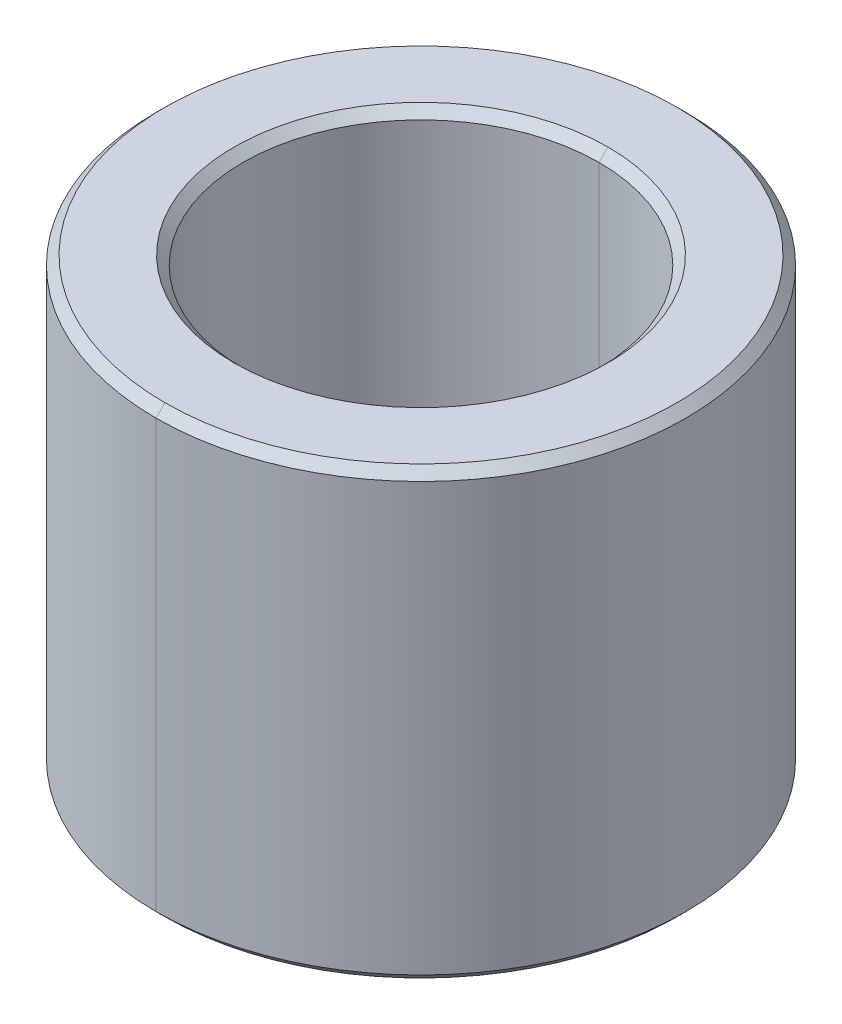
ISO-10303-21;
HEADER;
FILE_DESCRIPTION(('STEP AP214'),'2;1');
FILE_NAME('part.step','',(''),(''),'','','');
FILE_SCHEMA(('AUTOMOTIVE_DESIGN { 1 0 10303 214 1 1 1 1 }'));
ENDSEC;
DATA;
#1=APPLICATION_CONTEXT('core data for automotive mechanical design processes');
#2=APPLICATION_PROTOCOL_DEFINITION('international standard','automotive_design',2000,#1);
#3=PRODUCT_CONTEXT('',#1,'mechanical');
#4=PRODUCT('Part','Part','',(#3));
#5=PRODUCT_RELATED_PRODUCT_CATEGORY('part','',(#4));
#6=PRODUCT_DEFINITION_FORMATION('','',#4);
#7=PRODUCT_DEFINITION_CONTEXT('part definition',#1,'design');
#8=PRODUCT_DEFINITION('design','',#6,#7);
#9=PRODUCT_DEFINITION_SHAPE('','',#8);
#10=(LENGTH_UNIT() NAMED_UNIT(*) SI_UNIT(.MILLI.,.METRE.));
#11=(NAMED_UNIT(*) PLANE_ANGLE_UNIT() SI_UNIT($,.RADIAN.));
#12=(NAMED_UNIT(*) SI_UNIT($,.STERADIAN.) SOLID_ANGLE_UNIT());
#13=UNCERTAINTY_MEASURE_WITH_UNIT(LENGTH_MEASURE(1.E-05),#10,'distance_accuracy_value','');
#14=(GEOMETRIC_REPRESENTATION_CONTEXT(3) GLOBAL_UNCERTAINTY_ASSIGNED_CONTEXT((#13)) GLOBAL_UNIT_ASSIGNED_CONTEXT((#10,
#11,#12)) REPRESENTATION_CONTEXT('',''));
#15=CARTESIAN_POINT('',(0.,0.,0.));
#16=DIRECTION('',(0.,0.,1.));
#17=DIRECTION('',(1.,0.,0.));
#18=AXIS2_PLACEMENT_3D('',#15,#16,#17);
#19=CARTESIAN_POINT('',(0.,2.4,0.));
#20=DIRECTION('',(0.,1.,0.));
#21=DIRECTION('',(0.,0.,1.));
#22=AXIS2_PLACEMENT_3D('',#19,#20,#21);
#23=CONICAL_SURFACE('',#22,2.,0.78539816339745);
#24=DIRECTION('',(0.,0.707106781186546,-0.707106781186549));
#25=VECTOR('',#24,1.);
#26=CARTESIAN_POINT('',(0.,2.4,-2.));
#27=LINE('',#26,#25);
#28=CARTESIAN_POINT('',(0.,2.4,-2.));
#29=VERTEX_POINT('',#28);
#30=CARTESIAN_POINT('',(0.,2.5,-2.1));
#31=VERTEX_POINT('',#30);
#32=EDGE_CURVE('E250',#29,#31,#27,.T.);
#33=ORIENTED_EDGE('',*,*,#32,.F.);
#34=CARTESIAN_POINT('',(0.,2.4,0.));
#35=DIRECTION('',(0.,1.,0.));
#36=DIRECTION('',(0.,0.,1.));
#37=AXIS2_PLACEMENT_3D('',#34,#35,#36);
#38=CIRCLE('',#37,2.);
#39=CARTESIAN_POINT('',(0.,2.4,2.));
#40=VERTEX_POINT('',#39);
#41=EDGE_CURVE('E26',#40,#29,#38,.T.);
#42=ORIENTED_EDGE('',*,*,#41,.F.);
#43=DIRECTION('',(0.,0.707106781186546,0.707106781186549));
#44=VECTOR('',#43,1.);
#45=CARTESIAN_POINT('',(0.,2.4,2.));
#46=LINE('',#45,#44);
#47=CARTESIAN_POINT('',(0.,2.5,2.1));
#48=VERTEX_POINT('',#47);
#49=EDGE_CURVE('E155',#40,#48,#46,.T.);
#50=ORIENTED_EDGE('',*,*,#49,.T.);
#51=CARTESIAN_POINT('',(0.,2.5,0.));
#52=DIRECTION('',(0.,-1.,0.));
#53=DIRECTION('',(0.,0.,1.));
#54=AXIS2_PLACEMENT_3D('',#51,#52,#53);
#55=CIRCLE('',#54,2.1);
#56=EDGE_CURVE('E111',#31,#48,#55,.T.);
#57=ORIENTED_EDGE('',*,*,#56,.F.);
#58=EDGE_LOOP('',(#33,#42,#50,#57));
#59=FACE_BOUND('',#58,.T.);
#60=ADVANCED_FACE('F15',(#59),#23,.F.);
#61=CARTESIAN_POINT('',(0.,-2.5,0.));
#62=DIRECTION('',(0.,-1.,0.));
#63=DIRECTION('',(0.,0.,-1.));
#64=AXIS2_PLACEMENT_3D('',#61,#62,#63);
#65=CONICAL_SURFACE('',#64,2.1,0.78539816339744);
#66=DIRECTION('',(0.,-0.707106781186554,0.707106781186542));
#67=VECTOR('',#66,1.);
#68=CARTESIAN_POINT('',(0.,-2.5,2.1));
#69=LINE('',#68,#67);
#70=CARTESIAN_POINT('',(0.,-2.4,2.));
#71=VERTEX_POINT('',#70);
#72=CARTESIAN_POINT('',(0.,-2.5,2.1));
#73=VERTEX_POINT('',#72);
#74=EDGE_CURVE('E133',#71,#73,#69,.T.);
#75=ORIENTED_EDGE('',*,*,#74,.F.);
#76=CARTESIAN_POINT('',(0.,-2.4,0.));
#77=DIRECTION('',(0.,-1.,0.));
#78=DIRECTION('',(0.,0.,1.));
#79=AXIS2_PLACEMENT_3D('',#76,#77,#78);
#80=CIRCLE('',#79,2.);
#81=CARTESIAN_POINT('',(0.,-2.4,-2.));
#82=VERTEX_POINT('',#81);
#83=EDGE_CURVE('E10',#82,#71,#80,.T.);
#84=ORIENTED_EDGE('',*,*,#83,.F.);
#85=DIRECTION('',(0.,-0.707106781186554,-0.707106781186542));
#86=VECTOR('',#85,1.);
#87=CARTESIAN_POINT('',(0.,-2.5,-2.1));
#88=LINE('',#87,#86);
#89=CARTESIAN_POINT('',(0.,-2.5,-2.1));
#90=VERTEX_POINT('',#89);
#91=EDGE_CURVE('E136',#82,#90,#88,.T.);
#92=ORIENTED_EDGE('',*,*,#91,.T.);
#93=CARTESIAN_POINT('',(0.,-2.5,0.));
#94=DIRECTION('',(0.,1.,0.));
#95=DIRECTION('',(0.,0.,1.));
#96=AXIS2_PLACEMENT_3D('',#93,#94,#95);
#97=CIRCLE('',#96,2.1);
#98=EDGE_CURVE('E126',#73,#90,#97,.T.);
#99=ORIENTED_EDGE('',*,*,#98,.F.);
#100=EDGE_LOOP('',(#75,#84,#92,#99));
#101=FACE_BOUND('',#100,.T.);
#102=ADVANCED_FACE('F17',(#101),#65,.F.);
#103=CARTESIAN_POINT('',(0.,2.5,0.));
#104=DIRECTION('',(0.,-1.,0.));
#105=DIRECTION('',(0.,0.,-1.));
#106=AXIS2_PLACEMENT_3D('',#103,#104,#105);
#107=CONICAL_SURFACE('',#106,2.875,0.78539816339744);
#108=DIRECTION('',(0.,-0.707106781186554,0.707106781186542));
#109=VECTOR('',#108,1.);
#110=CARTESIAN_POINT('',(0.,2.5,2.875));
#111=LINE('',#110,#109);
#112=CARTESIAN_POINT('',(0.,2.5,2.875));
#113=VERTEX_POINT('',#112);
#114=CARTESIAN_POINT('',(0.,2.4,2.975));
#115=VERTEX_POINT('',#114);
#116=EDGE_CURVE('E173',#113,#115,#111,.T.);
#117=ORIENTED_EDGE('',*,*,#116,.F.);
#118=CARTESIAN_POINT('',(0.,2.5,0.));
#119=DIRECTION('',(0.,1.,0.));
#120=DIRECTION('',(0.,0.,1.));
#121=AXIS2_PLACEMENT_3D('',#118,#119,#120);
#122=CIRCLE('',#121,2.875);
#123=CARTESIAN_POINT('',(0.,2.5,-2.875));
#124=VERTEX_POINT('',#123);
#125=EDGE_CURVE('E160',#124,#113,#122,.T.);
#126=ORIENTED_EDGE('',*,*,#125,.F.);
#127=DIRECTION('',(0.,-0.707106781186554,-0.707106781186542));
#128=VECTOR('',#127,1.);
#129=CARTESIAN_POINT('',(0.,2.5,-2.875));
#130=LINE('',#129,#128);
#131=CARTESIAN_POINT('',(0.,2.4,-2.975));
#132=VERTEX_POINT('',#131);
#133=EDGE_CURVE('E172',#124,#132,#130,.T.);
#134=ORIENTED_EDGE('',*,*,#133,.T.);
#135=CARTESIAN_POINT('',(0.,2.4,0.));
#136=DIRECTION('',(0.,-1.,0.));
#137=DIRECTION('',(0.,0.,1.));
#138=AXIS2_PLACEMENT_3D('',#135,#136,#137);
#139=CIRCLE('',#138,2.975);
#140=EDGE_CURVE('E66',#115,#132,#139,.T.);
#141=ORIENTED_EDGE('',*,*,#140,.F.);
#142=EDGE_LOOP('',(#117,#126,#134,#141));
#143=FACE_BOUND('',#142,.T.);
#144=ADVANCED_FACE('F198',(#143),#107,.T.);
#145=CARTESIAN_POINT('',(0.,-2.4,0.));
#146=DIRECTION('',(0.,1.,0.));
#147=DIRECTION('',(0.,0.,1.));
#148=AXIS2_PLACEMENT_3D('',#145,#146,#147);
#149=CONICAL_SURFACE('',#148,2.975,0.785398163397446);
#150=DIRECTION('',(0.,0.707106781186549,-0.707106781186546));
#151=VECTOR('',#150,1.);
#152=CARTESIAN_POINT('',(0.,-2.4,-2.975));
#153=LINE('',#152,#151);
#154=CARTESIAN_POINT('',(0.,-2.5,-2.875));
#155=VERTEX_POINT('',#154);
#156=CARTESIAN_POINT('',(0.,-2.4,-2.975));
#157=VERTEX_POINT('',#156);
#158=EDGE_CURVE('E174',#155,#157,#153,.T.);
#159=ORIENTED_EDGE('',*,*,#158,.F.);
#160=CARTESIAN_POINT('',(0.,-2.5,0.));
#161=DIRECTION('',(0.,-1.,0.));
#162=DIRECTION('',(0.,0.,1.));
#163=AXIS2_PLACEMENT_3D('',#160,#161,#162);
#164=CIRCLE('',#163,2.875);
#165=CARTESIAN_POINT('',(0.,-2.5,2.875));
#166=VERTEX_POINT('',#165);
#167=EDGE_CURVE('E57',#166,#155,#164,.T.);
#168=ORIENTED_EDGE('',*,*,#167,.F.);
#169=DIRECTION('',(0.,0.707106781186549,0.707106781186546));
#170=VECTOR('',#169,1.);
#171=CARTESIAN_POINT('',(0.,-2.4,2.975));
#172=LINE('',#171,#170);
#173=CARTESIAN_POINT('',(0.,-2.4,2.975));
#174=VERTEX_POINT('',#173);
#175=EDGE_CURVE('E166',#166,#174,#172,.T.);
#176=ORIENTED_EDGE('',*,*,#175,.T.);
#177=CARTESIAN_POINT('',(0.,-2.4,0.));
#178=DIRECTION('',(0.,1.,0.));
#179=DIRECTION('',(0.,0.,1.));
#180=AXIS2_PLACEMENT_3D('',#177,#178,#179);
#181=CIRCLE('',#180,2.975);
#182=EDGE_CURVE('E41',#157,#174,#181,.T.);
#183=ORIENTED_EDGE('',*,*,#182,.F.);
#184=EDGE_LOOP('',(#159,#168,#176,#183));
#185=FACE_BOUND('',#184,.T.);
#186=ADVANCED_FACE('F225',(#185),#149,.T.);
#187=CARTESIAN_POINT('',(0.,2.5,0.));
#188=DIRECTION('',(0.,-1.,0.));
#189=DIRECTION('',(0.,0.,-1.));
#190=AXIS2_PLACEMENT_3D('',#187,#188,#189);
#191=CYLINDRICAL_SURFACE('',#190,2.);
#192=DIRECTION('',(0.,-1.,0.));
#193=VECTOR('',#192,1.);
#194=CARTESIAN_POINT('',(0.,2.5,2.));
#195=LINE('',#194,#193);
#196=EDGE_CURVE('E163',#40,#71,#195,.T.);
#197=ORIENTED_EDGE('',*,*,#196,.F.);
#198=ORIENTED_EDGE('',*,*,#41,.T.);
#199=DIRECTION('',(0.,-1.,0.));
#200=VECTOR('',#199,1.);
#201=CARTESIAN_POINT('',(0.,2.5,-2.));
#202=LINE('',#201,#200);
#203=EDGE_CURVE('E165',#29,#82,#202,.T.);
#204=ORIENTED_EDGE('',*,*,#203,.T.);
#205=ORIENTED_EDGE('',*,*,#83,.T.);
#206=EDGE_LOOP('',(#197,#198,#204,#205));
#207=FACE_BOUND('',#206,.T.);
#208=ADVANCED_FACE('F223',(#207),#191,.F.);
#209=CARTESIAN_POINT('',(0.,2.5,0.));
#210=DIRECTION('',(0.,-1.,0.));
#211=DIRECTION('',(0.,0.,-1.));
#212=AXIS2_PLACEMENT_3D('',#209,#210,#211);
#213=CYLINDRICAL_SURFACE('',#212,2.975);
#214=DIRECTION('',(0.,-1.,0.));
#215=VECTOR('',#214,1.);
#216=CARTESIAN_POINT('',(0.,2.5,2.975));
#217=LINE('',#216,#215);
#218=EDGE_CURVE('E253',#115,#174,#217,.T.);
#219=ORIENTED_EDGE('',*,*,#218,.F.);
#220=ORIENTED_EDGE('',*,*,#140,.T.);
#221=DIRECTION('',(0.,-1.,0.));
#222=VECTOR('',#221,1.);
#223=CARTESIAN_POINT('',(0.,2.5,-2.975));
#224=LINE('',#223,#222);
#225=EDGE_CURVE('E161',#132,#157,#224,.T.);
#226=ORIENTED_EDGE('',*,*,#225,.T.);
#227=ORIENTED_EDGE('',*,*,#182,.T.);
#228=EDGE_LOOP('',(#219,#220,#226,#227));
#229=FACE_BOUND('',#228,.T.);
#230=ADVANCED_FACE('F212',(#229),#213,.T.);
#231=CARTESIAN_POINT('',(0.,-2.5,0.));
#232=DIRECTION('',(0.,1.,0.));
#233=DIRECTION('',(1.,0.,0.));
#234=AXIS2_PLACEMENT_3D('',#231,#232,#233);
#235=PLANE('',#234);
#236=CARTESIAN_POINT('',(0.,-2.5,0.));
#237=DIRECTION('',(0.,1.,0.));
#238=DIRECTION('',(0.,0.,1.));
#239=AXIS2_PLACEMENT_3D('',#236,#237,#238);
#240=CIRCLE('',#239,2.1);
#241=EDGE_CURVE('E140',#90,#73,#240,.T.);
#242=ORIENTED_EDGE('',*,*,#241,.T.);
#243=ORIENTED_EDGE('',*,*,#98,.T.);
#244=EDGE_LOOP('',(#242,#243));
#245=FACE_BOUND('',#244,.T.);
#246=ORIENTED_EDGE('',*,*,#167,.T.);
#247=CARTESIAN_POINT('',(0.,-2.5,0.));
#248=DIRECTION('',(0.,-1.,0.));
#249=DIRECTION('',(0.,0.,1.));
#250=AXIS2_PLACEMENT_3D('',#247,#248,#249);
#251=CIRCLE('',#250,2.875);
#252=EDGE_CURVE('E179',#155,#166,#251,.T.);
#253=ORIENTED_EDGE('',*,*,#252,.T.);
#254=EDGE_LOOP('',(#246,#253));
#255=FACE_BOUND('',#254,.T.);
#256=ADVANCED_FACE('F141',(#245,#255),#235,.F.);
#257=CARTESIAN_POINT('',(0.,2.5,0.));
#258=DIRECTION('',(0.,1.,0.));
#259=DIRECTION('',(1.,0.,0.));
#260=AXIS2_PLACEMENT_3D('',#257,#258,#259);
#261=PLANE('',#260);
#262=CARTESIAN_POINT('',(0.,2.5,0.));
#263=DIRECTION('',(0.,-1.,0.));
#264=DIRECTION('',(0.,0.,1.));
#265=AXIS2_PLACEMENT_3D('',#262,#263,#264);
#266=CIRCLE('',#265,2.1);
#267=EDGE_CURVE('E247',#48,#31,#266,.T.);
#268=ORIENTED_EDGE('',*,*,#267,.T.);
#269=ORIENTED_EDGE('',*,*,#56,.T.);
#270=EDGE_LOOP('',(#268,#269));
#271=FACE_BOUND('',#270,.T.);
#272=ORIENTED_EDGE('',*,*,#125,.T.);
#273=CARTESIAN_POINT('',(0.,2.5,0.));
#274=DIRECTION('',(0.,1.,0.));
#275=DIRECTION('',(0.,0.,1.));
#276=AXIS2_PLACEMENT_3D('',#273,#274,#275);
#277=CIRCLE('',#276,2.875);
#278=EDGE_CURVE('E183',#113,#124,#277,.T.);
#279=ORIENTED_EDGE('',*,*,#278,.T.);
#280=EDGE_LOOP('',(#272,#279));
#281=FACE_BOUND('',#280,.T.);
#282=ADVANCED_FACE('F200',(#271,#281),#261,.T.);
#283=CARTESIAN_POINT('',(0.,2.5,0.));
#284=DIRECTION('',(0.,-1.,0.));
#285=DIRECTION('',(0.,0.,-1.));
#286=AXIS2_PLACEMENT_3D('',#283,#284,#285);
#287=CYLINDRICAL_SURFACE('',#286,2.975);
#288=CARTESIAN_POINT('',(0.,2.4,0.));
#289=DIRECTION('',(0.,-1.,0.));
#290=DIRECTION('',(0.,0.,1.));
#291=AXIS2_PLACEMENT_3D('',#288,#289,#290);
#292=CIRCLE('',#291,2.975);
#293=EDGE_CURVE('E168',#132,#115,#292,.T.);
#294=ORIENTED_EDGE('',*,*,#293,.T.);
#295=ORIENTED_EDGE('',*,*,#218,.T.);
#296=CARTESIAN_POINT('',(0.,-2.4,0.));
#297=DIRECTION('',(0.,1.,0.));
#298=DIRECTION('',(0.,0.,1.));
#299=AXIS2_PLACEMENT_3D('',#296,#297,#298);
#300=CIRCLE('',#299,2.975);
#301=EDGE_CURVE('E178',#174,#157,#300,.T.);
#302=ORIENTED_EDGE('',*,*,#301,.T.);
#303=ORIENTED_EDGE('',*,*,#225,.F.);
#304=EDGE_LOOP('',(#294,#295,#302,#303));
#305=FACE_BOUND('',#304,.T.);
#306=ADVANCED_FACE('F202',(#305),#287,.T.);
#307=CARTESIAN_POINT('',(0.,2.5,0.));
#308=DIRECTION('',(0.,-1.,0.));
#309=DIRECTION('',(0.,0.,-1.));
#310=AXIS2_PLACEMENT_3D('',#307,#308,#309);
#311=CYLINDRICAL_SURFACE('',#310,2.);
#312=CARTESIAN_POINT('',(0.,2.4,0.));
#313=DIRECTION('',(0.,1.,0.));
#314=DIRECTION('',(0.,0.,1.));
#315=AXIS2_PLACEMENT_3D('',#312,#313,#314);
#316=CIRCLE('',#315,2.);
#317=EDGE_CURVE('E19',#29,#40,#316,.T.);
#318=ORIENTED_EDGE('',*,*,#317,.T.);
#319=ORIENTED_EDGE('',*,*,#196,.T.);
#320=CARTESIAN_POINT('',(0.,-2.4,0.));
#321=DIRECTION('',(0.,-1.,0.));
#322=DIRECTION('',(0.,0.,1.));
#323=AXIS2_PLACEMENT_3D('',#320,#321,#322);
#324=CIRCLE('',#323,2.);
#325=EDGE_CURVE('E147',#71,#82,#324,.T.);
#326=ORIENTED_EDGE('',*,*,#325,.T.);
#327=ORIENTED_EDGE('',*,*,#203,.F.);
#328=EDGE_LOOP('',(#318,#319,#326,#327));
#329=FACE_BOUND('',#328,.T.);
#330=ADVANCED_FACE('F209',(#329),#311,.F.);
#331=CARTESIAN_POINT('',(0.,-2.4,0.));
#332=DIRECTION('',(0.,1.,0.));
#333=DIRECTION('',(0.,0.,1.));
#334=AXIS2_PLACEMENT_3D('',#331,#332,#333);
#335=CONICAL_SURFACE('',#334,2.975,0.785398163397446);
#336=ORIENTED_EDGE('',*,*,#252,.F.);
#337=ORIENTED_EDGE('',*,*,#158,.T.);
#338=ORIENTED_EDGE('',*,*,#301,.F.);
#339=ORIENTED_EDGE('',*,*,#175,.F.);
#340=EDGE_LOOP('',(#336,#337,#338,#339));
#341=FACE_BOUND('',#340,.T.);
#342=ADVANCED_FACE('F238',(#341),#335,.T.);
#343=CARTESIAN_POINT('',(0.,2.5,0.));
#344=DIRECTION('',(0.,-1.,0.));
#345=DIRECTION('',(0.,0.,-1.));
#346=AXIS2_PLACEMENT_3D('',#343,#344,#345);
#347=CONICAL_SURFACE('',#346,2.875,0.78539816339744);
#348=ORIENTED_EDGE('',*,*,#278,.F.);
#349=ORIENTED_EDGE('',*,*,#116,.T.);
#350=ORIENTED_EDGE('',*,*,#293,.F.);
#351=ORIENTED_EDGE('',*,*,#133,.F.);
#352=EDGE_LOOP('',(#348,#349,#350,#351));
#353=FACE_BOUND('',#352,.T.);
#354=ADVANCED_FACE('F196',(#353),#347,.T.);
#355=CARTESIAN_POINT('',(0.,-2.5,0.));
#356=DIRECTION('',(0.,-1.,0.));
#357=DIRECTION('',(0.,0.,-1.));
#358=AXIS2_PLACEMENT_3D('',#355,#356,#357);
#359=CONICAL_SURFACE('',#358,2.1,0.78539816339744);
#360=ORIENTED_EDGE('',*,*,#325,.F.);
#361=ORIENTED_EDGE('',*,*,#74,.T.);
#362=ORIENTED_EDGE('',*,*,#241,.F.);
#363=ORIENTED_EDGE('',*,*,#91,.F.);
#364=EDGE_LOOP('',(#360,#361,#362,#363));
#365=FACE_BOUND('',#364,.T.);
#366=ADVANCED_FACE('F145',(#365),#359,.F.);
#367=CARTESIAN_POINT('',(0.,2.4,0.));
#368=DIRECTION('',(0.,1.,0.));
#369=DIRECTION('',(0.,0.,1.));
#370=AXIS2_PLACEMENT_3D('',#367,#368,#369);
#371=CONICAL_SURFACE('',#370,2.,0.78539816339745);
#372=ORIENTED_EDGE('',*,*,#317,.F.);
#373=ORIENTED_EDGE('',*,*,#32,.T.);
#374=ORIENTED_EDGE('',*,*,#267,.F.);
#375=ORIENTED_EDGE('',*,*,#49,.F.);
#376=EDGE_LOOP('',(#372,#373,#374,#375));
#377=FACE_BOUND('',#376,.T.);
#378=ADVANCED_FACE('F272',(#377),#371,.F.);
#379=CLOSED_SHELL('',(#60,#102,#144,#186,#208,#230,#256,#282,#306,#330,#342,#354,#366,#378));
#380=MANIFOLD_SOLID_BREP('B1',#379);
#381=ADVANCED_BREP_SHAPE_REPRESENTATION('',(#18,#380),#14);
#382=SHAPE_DEFINITION_REPRESENTATION(#9,#381);
ENDSEC;
END-ISO-10303-21;
